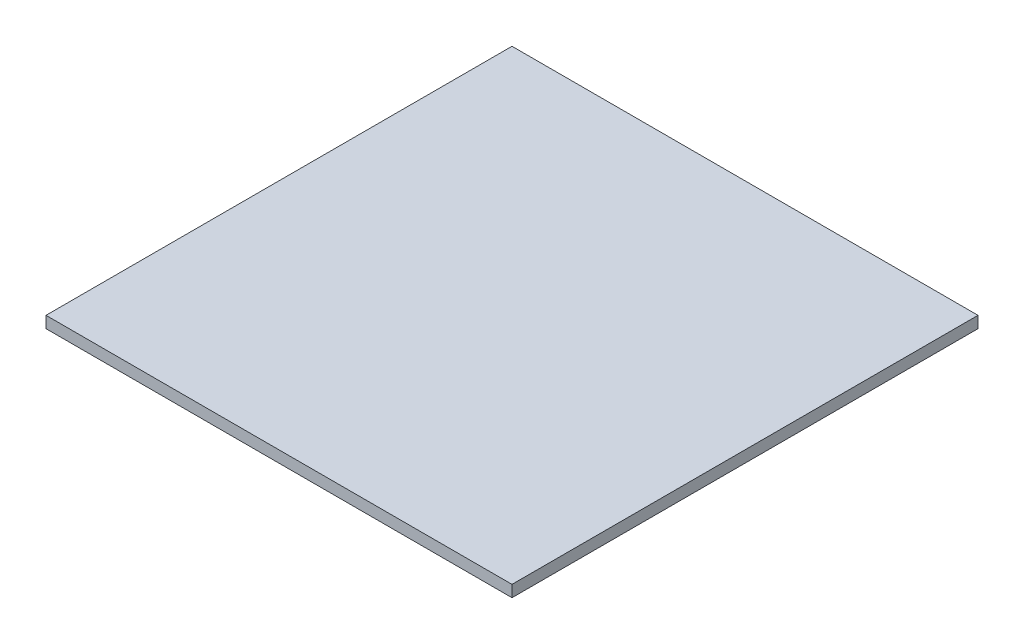
ISO-10303-21;
HEADER;
FILE_DESCRIPTION(('STEP AP214'),'2;1');
FILE_NAME('part.step','',(''),(''),'','','');
FILE_SCHEMA(('AUTOMOTIVE_DESIGN { 1 0 10303 214 1 1 1 1 }'));
ENDSEC;
DATA;
#1=APPLICATION_CONTEXT('core data for automotive mechanical design processes');
#2=APPLICATION_PROTOCOL_DEFINITION('international standard','automotive_design',2000,#1);
#3=PRODUCT_CONTEXT('',#1,'mechanical');
#4=PRODUCT('Part','Part','',(#3));
#5=PRODUCT_RELATED_PRODUCT_CATEGORY('part','',(#4));
#6=PRODUCT_DEFINITION_FORMATION('','',#4);
#7=PRODUCT_DEFINITION_CONTEXT('part definition',#1,'design');
#8=PRODUCT_DEFINITION('design','',#6,#7);
#9=PRODUCT_DEFINITION_SHAPE('','',#8);
#10=(LENGTH_UNIT() NAMED_UNIT(*) SI_UNIT(.MILLI.,.METRE.));
#11=(NAMED_UNIT(*) PLANE_ANGLE_UNIT() SI_UNIT($,.RADIAN.));
#12=(NAMED_UNIT(*) SI_UNIT($,.STERADIAN.) SOLID_ANGLE_UNIT());
#13=UNCERTAINTY_MEASURE_WITH_UNIT(LENGTH_MEASURE(1.E-05),#10,'distance_accuracy_value','');
#14=(GEOMETRIC_REPRESENTATION_CONTEXT(3) GLOBAL_UNCERTAINTY_ASSIGNED_CONTEXT((#13)) GLOBAL_UNIT_ASSIGNED_CONTEXT((#10,
#11,#12)) REPRESENTATION_CONTEXT('',''));
#15=CARTESIAN_POINT('',(0.,0.,0.));
#16=DIRECTION('',(0.,0.,1.));
#17=DIRECTION('',(1.,0.,0.));
#18=AXIS2_PLACEMENT_3D('',#15,#16,#17);
#19=CARTESIAN_POINT('',(90.5,2.25,90.5));
#20=DIRECTION('',(-1.,0.,0.));
#21=DIRECTION('',(0.,0.,1.));
#22=AXIS2_PLACEMENT_3D('',#19,#20,#21);
#23=PLANE('',#22);
#24=DIRECTION('',(0.,0.,-1.));
#25=VECTOR('',#24,1.);
#26=CARTESIAN_POINT('',(90.5,-2.25,90.5));
#27=LINE('',#26,#25);
#28=CARTESIAN_POINT('',(90.5,-2.25,90.5));
#29=VERTEX_POINT('',#28);
#30=CARTESIAN_POINT('',(90.5,-2.25,-90.5));
#31=VERTEX_POINT('',#30);
#32=EDGE_CURVE('E95',#29,#31,#27,.T.);
#33=ORIENTED_EDGE('',*,*,#32,.T.);
#34=DIRECTION('',(0.,-1.,0.));
#35=VECTOR('',#34,1.);
#36=CARTESIAN_POINT('',(90.5,2.25,-90.5));
#37=LINE('',#36,#35);
#38=CARTESIAN_POINT('',(90.5,2.25,-90.5));
#39=VERTEX_POINT('',#38);
#40=EDGE_CURVE('E11',#39,#31,#37,.T.);
#41=ORIENTED_EDGE('',*,*,#40,.F.);
#42=DIRECTION('',(0.,0.,-1.));
#43=VECTOR('',#42,1.);
#44=CARTESIAN_POINT('',(90.5,2.25,90.5));
#45=LINE('',#44,#43);
#46=CARTESIAN_POINT('',(90.5,2.25,90.5));
#47=VERTEX_POINT('',#46);
#48=EDGE_CURVE('E83',#47,#39,#45,.T.);
#49=ORIENTED_EDGE('',*,*,#48,.F.);
#50=DIRECTION('',(0.,-1.,0.));
#51=VECTOR('',#50,1.);
#52=CARTESIAN_POINT('',(90.5,2.25,90.5));
#53=LINE('',#52,#51);
#54=EDGE_CURVE('E91',#47,#29,#53,.T.);
#55=ORIENTED_EDGE('',*,*,#54,.T.);
#56=EDGE_LOOP('',(#33,#41,#49,#55));
#57=FACE_BOUND('',#56,.T.);
#58=ADVANCED_FACE('F32',(#57),#23,.F.);
#59=CARTESIAN_POINT('',(-90.5,2.25,-90.5));
#60=DIRECTION('',(0.,0.,1.));
#61=DIRECTION('',(1.,0.,0.));
#62=AXIS2_PLACEMENT_3D('',#59,#60,#61);
#63=PLANE('',#62);
#64=DIRECTION('',(-1.,0.,0.));
#65=VECTOR('',#64,1.);
#66=CARTESIAN_POINT('',(-90.5,-2.25,-90.5));
#67=LINE('',#66,#65);
#68=CARTESIAN_POINT('',(-90.5,-2.25,-90.5));
#69=VERTEX_POINT('',#68);
#70=EDGE_CURVE('E87',#31,#69,#67,.T.);
#71=ORIENTED_EDGE('',*,*,#70,.T.);
#72=DIRECTION('',(0.,-1.,0.));
#73=VECTOR('',#72,1.);
#74=CARTESIAN_POINT('',(-90.5,2.25,-90.5));
#75=LINE('',#74,#73);
#76=CARTESIAN_POINT('',(-90.5,2.25,-90.5));
#77=VERTEX_POINT('',#76);
#78=EDGE_CURVE('E40',#77,#69,#75,.T.);
#79=ORIENTED_EDGE('',*,*,#78,.F.);
#80=DIRECTION('',(-1.,0.,0.));
#81=VECTOR('',#80,1.);
#82=CARTESIAN_POINT('',(-90.5,2.25,-90.5));
#83=LINE('',#82,#81);
#84=EDGE_CURVE('E78',#39,#77,#83,.T.);
#85=ORIENTED_EDGE('',*,*,#84,.F.);
#86=ORIENTED_EDGE('',*,*,#40,.T.);
#87=EDGE_LOOP('',(#71,#79,#85,#86));
#88=FACE_BOUND('',#87,.T.);
#89=ADVANCED_FACE('F86',(#88),#63,.F.);
#90=CARTESIAN_POINT('',(-90.5,2.25,90.5));
#91=DIRECTION('',(1.,0.,0.));
#92=DIRECTION('',(0.,0.,-1.));
#93=AXIS2_PLACEMENT_3D('',#90,#91,#92);
#94=PLANE('',#93);
#95=DIRECTION('',(0.,0.,1.));
#96=VECTOR('',#95,1.);
#97=CARTESIAN_POINT('',(-90.5,-2.25,90.5));
#98=LINE('',#97,#96);
#99=CARTESIAN_POINT('',(-90.5,-2.25,90.5));
#100=VERTEX_POINT('',#99);
#101=EDGE_CURVE('E65',#69,#100,#98,.T.);
#102=ORIENTED_EDGE('',*,*,#101,.T.);
#103=DIRECTION('',(0.,-1.,0.));
#104=VECTOR('',#103,1.);
#105=CARTESIAN_POINT('',(-90.5,2.25,90.5));
#106=LINE('',#105,#104);
#107=CARTESIAN_POINT('',(-90.5,2.25,90.5));
#108=VERTEX_POINT('',#107);
#109=EDGE_CURVE('E88',#108,#100,#106,.T.);
#110=ORIENTED_EDGE('',*,*,#109,.F.);
#111=DIRECTION('',(0.,0.,1.));
#112=VECTOR('',#111,1.);
#113=CARTESIAN_POINT('',(-90.5,2.25,90.5));
#114=LINE('',#113,#112);
#115=EDGE_CURVE('E81',#77,#108,#114,.T.);
#116=ORIENTED_EDGE('',*,*,#115,.F.);
#117=ORIENTED_EDGE('',*,*,#78,.T.);
#118=EDGE_LOOP('',(#102,#110,#116,#117));
#119=FACE_BOUND('',#118,.T.);
#120=ADVANCED_FACE('F89',(#119),#94,.F.);
#121=CARTESIAN_POINT('',(-90.5,2.25,90.5));
#122=DIRECTION('',(0.,0.,-1.));
#123=DIRECTION('',(-1.,0.,0.));
#124=AXIS2_PLACEMENT_3D('',#121,#122,#123);
#125=PLANE('',#124);
#126=DIRECTION('',(1.,0.,0.));
#127=VECTOR('',#126,1.);
#128=CARTESIAN_POINT('',(-90.5,-2.25,90.5));
#129=LINE('',#128,#127);
#130=EDGE_CURVE('E71',#100,#29,#129,.T.);
#131=ORIENTED_EDGE('',*,*,#130,.T.);
#132=ORIENTED_EDGE('',*,*,#54,.F.);
#133=DIRECTION('',(1.,0.,0.));
#134=VECTOR('',#133,1.);
#135=CARTESIAN_POINT('',(-90.5,2.25,90.5));
#136=LINE('',#135,#134);
#137=EDGE_CURVE('E48',#108,#47,#136,.T.);
#138=ORIENTED_EDGE('',*,*,#137,.F.);
#139=ORIENTED_EDGE('',*,*,#109,.T.);
#140=EDGE_LOOP('',(#131,#132,#138,#139));
#141=FACE_BOUND('',#140,.T.);
#142=ADVANCED_FACE('F102',(#141),#125,.F.);
#143=CARTESIAN_POINT('',(0.,2.25,0.));
#144=DIRECTION('',(0.,-1.,0.));
#145=DIRECTION('',(0.,0.,-1.));
#146=AXIS2_PLACEMENT_3D('',#143,#144,#145);
#147=PLANE('',#146);
#148=ORIENTED_EDGE('',*,*,#48,.T.);
#149=ORIENTED_EDGE('',*,*,#84,.T.);
#150=ORIENTED_EDGE('',*,*,#115,.T.);
#151=ORIENTED_EDGE('',*,*,#137,.T.);
#152=EDGE_LOOP('',(#148,#149,#150,#151));
#153=FACE_BOUND('',#152,.T.);
#154=ADVANCED_FACE('F79',(#153),#147,.F.);
#155=CARTESIAN_POINT('',(0.,-2.25,0.));
#156=DIRECTION('',(0.,-1.,0.));
#157=DIRECTION('',(0.,0.,-1.));
#158=AXIS2_PLACEMENT_3D('',#155,#156,#157);
#159=PLANE('',#158);
#160=ORIENTED_EDGE('',*,*,#32,.F.);
#161=ORIENTED_EDGE('',*,*,#130,.F.);
#162=ORIENTED_EDGE('',*,*,#101,.F.);
#163=ORIENTED_EDGE('',*,*,#70,.F.);
#164=EDGE_LOOP('',(#160,#161,#162,#163));
#165=FACE_BOUND('',#164,.T.);
#166=ADVANCED_FACE('F105',(#165),#159,.T.);
#167=CLOSED_SHELL('',(#58,#89,#120,#142,#154,#166));
#168=MANIFOLD_SOLID_BREP('B2',#167);
#169=ADVANCED_BREP_SHAPE_REPRESENTATION('',(#18,#168),#14);
#170=SHAPE_DEFINITION_REPRESENTATION(#9,#169);
ENDSEC;
END-ISO-10303-21;
